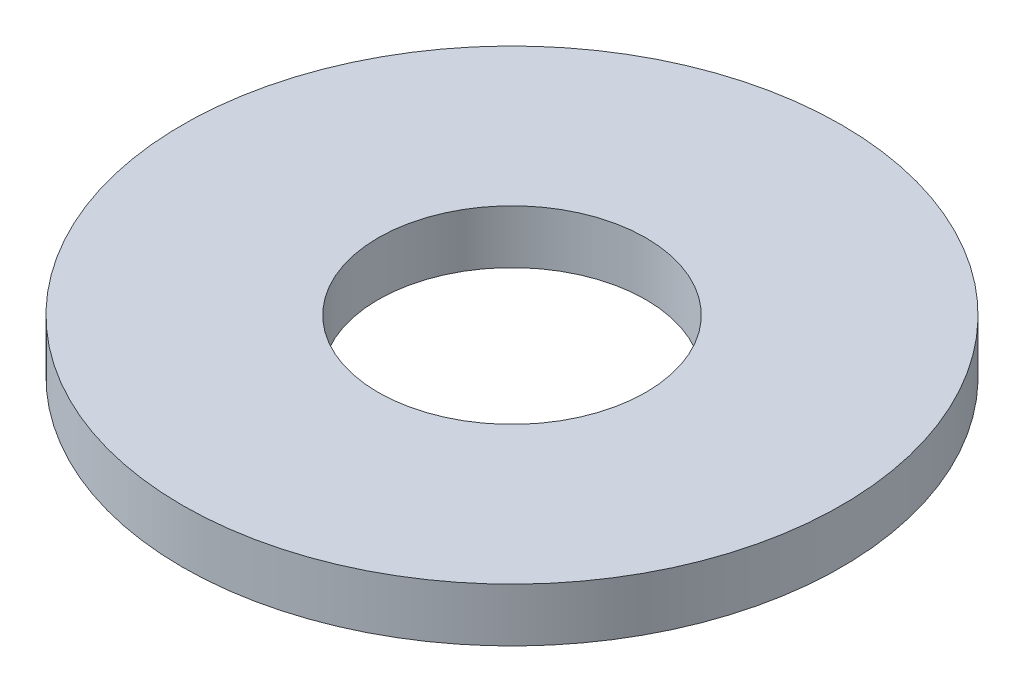
ISO-10303-21;
HEADER;
FILE_DESCRIPTION(('STEP AP214'),'2;1');
FILE_NAME('part.step','',(''),(''),'','','');
FILE_SCHEMA(('AUTOMOTIVE_DESIGN { 1 0 10303 214 1 1 1 1 }'));
ENDSEC;
DATA;
#1=APPLICATION_CONTEXT('core data for automotive mechanical design processes');
#2=APPLICATION_PROTOCOL_DEFINITION('international standard','automotive_design',2000,#1);
#3=PRODUCT_CONTEXT('',#1,'mechanical');
#4=PRODUCT('Part','Part','',(#3));
#5=PRODUCT_RELATED_PRODUCT_CATEGORY('part','',(#4));
#6=PRODUCT_DEFINITION_FORMATION('','',#4);
#7=PRODUCT_DEFINITION_CONTEXT('part definition',#1,'design');
#8=PRODUCT_DEFINITION('design','',#6,#7);
#9=PRODUCT_DEFINITION_SHAPE('','',#8);
#10=(LENGTH_UNIT() NAMED_UNIT(*) SI_UNIT(.MILLI.,.METRE.));
#11=(NAMED_UNIT(*) PLANE_ANGLE_UNIT() SI_UNIT($,.RADIAN.));
#12=(NAMED_UNIT(*) SI_UNIT($,.STERADIAN.) SOLID_ANGLE_UNIT());
#13=UNCERTAINTY_MEASURE_WITH_UNIT(LENGTH_MEASURE(1.E-05),#10,'distance_accuracy_value','');
#14=(GEOMETRIC_REPRESENTATION_CONTEXT(3) GLOBAL_UNCERTAINTY_ASSIGNED_CONTEXT((#13)) GLOBAL_UNIT_ASSIGNED_CONTEXT((#10,
#11,#12)) REPRESENTATION_CONTEXT('',''));
#15=CARTESIAN_POINT('',(0.,0.,0.));
#16=DIRECTION('',(0.,0.,1.));
#17=DIRECTION('',(1.,0.,0.));
#18=AXIS2_PLACEMENT_3D('',#15,#16,#17);
#19=CARTESIAN_POINT('',(0.,13.,0.));
#20=DIRECTION('',(0.,-1.,0.));
#21=DIRECTION('',(0.,0.,-1.));
#22=AXIS2_PLACEMENT_3D('',#19,#20,#21);
#23=CYLINDRICAL_SURFACE('',#22,80.);
#24=CARTESIAN_POINT('',(0.,13.,0.));
#25=DIRECTION('',(0.,1.,0.));
#26=DIRECTION('',(0.,0.,1.));
#27=AXIS2_PLACEMENT_3D('',#24,#25,#26);
#28=CIRCLE('',#27,80.);
#29=CARTESIAN_POINT('',(0.,13.,-80.));
#30=VERTEX_POINT('',#29);
#31=EDGE_CURVE('E10',#30,#30,#28,.T.);
#32=CARTESIAN_POINT('',(0.,0.,0.));
#33=DIRECTION('',(0.,1.,0.));
#34=DIRECTION('',(0.,0.,1.));
#35=AXIS2_PLACEMENT_3D('',#32,#33,#34);
#36=CIRCLE('',#35,80.);
#37=CARTESIAN_POINT('',(0.,0.,-80.));
#38=VERTEX_POINT('',#37);
#39=EDGE_CURVE('E37',#38,#38,#36,.T.);
#40=CARTESIAN_POINT('',(0.,13.,-80.));
#41=CARTESIAN_POINT('',(0.,12.8645833333333,-80.));
#42=CARTESIAN_POINT('',(0.,12.7291666666667,-80.));
#43=CARTESIAN_POINT('',(0.,12.4583333333333,-80.));
#44=CARTESIAN_POINT('',(0.,12.3229166666667,-80.));
#45=CARTESIAN_POINT('',(0.,12.0520833333333,-80.));
#46=CARTESIAN_POINT('',(0.,11.9166666666667,-80.));
#47=CARTESIAN_POINT('',(0.,11.6458333333333,-80.));
#48=CARTESIAN_POINT('',(0.,11.5104166666667,-80.));
#49=CARTESIAN_POINT('',(0.,11.2395833333333,-80.));
#50=CARTESIAN_POINT('',(0.,11.1041666666667,-80.));
#51=CARTESIAN_POINT('',(0.,10.8333333333333,-80.));
#52=CARTESIAN_POINT('',(0.,10.6979166666667,-80.));
#53=CARTESIAN_POINT('',(0.,10.4270833333333,-80.));
#54=CARTESIAN_POINT('',(0.,10.2916666666667,-80.));
#55=CARTESIAN_POINT('',(0.,10.0208333333333,-80.));
#56=CARTESIAN_POINT('',(0.,9.88541666666667,-80.));
#57=CARTESIAN_POINT('',(0.,9.61458333333333,-80.));
#58=CARTESIAN_POINT('',(0.,9.47916666666667,-80.));
#59=CARTESIAN_POINT('',(0.,9.20833333333333,-80.));
#60=CARTESIAN_POINT('',(0.,9.07291666666667,-80.));
#61=CARTESIAN_POINT('',(0.,8.80208333333333,-80.));
#62=CARTESIAN_POINT('',(0.,8.66666666666667,-80.));
#63=CARTESIAN_POINT('',(0.,8.39583333333333,-80.));
#64=CARTESIAN_POINT('',(0.,8.26041666666667,-80.));
#65=CARTESIAN_POINT('',(0.,7.98958333333333,-80.));
#66=CARTESIAN_POINT('',(0.,7.85416666666667,-80.));
#67=CARTESIAN_POINT('',(0.,7.58333333333333,-80.));
#68=CARTESIAN_POINT('',(0.,7.44791666666667,-80.));
#69=CARTESIAN_POINT('',(0.,7.17708333333333,-80.));
#70=CARTESIAN_POINT('',(0.,7.04166666666667,-80.));
#71=CARTESIAN_POINT('',(0.,6.77083333333333,-80.));
#72=CARTESIAN_POINT('',(0.,6.63541666666667,-80.));
#73=CARTESIAN_POINT('',(0.,6.36458333333333,-80.));
#74=CARTESIAN_POINT('',(0.,6.22916666666667,-80.));
#75=CARTESIAN_POINT('',(0.,5.95833333333333,-80.));
#76=CARTESIAN_POINT('',(0.,5.82291666666667,-80.));
#77=CARTESIAN_POINT('',(0.,5.55208333333333,-80.));
#78=CARTESIAN_POINT('',(0.,5.41666666666667,-80.));
#79=CARTESIAN_POINT('',(0.,5.14583333333333,-80.));
#80=CARTESIAN_POINT('',(0.,5.01041666666667,-80.));
#81=CARTESIAN_POINT('',(0.,4.73958333333333,-80.));
#82=CARTESIAN_POINT('',(0.,4.60416666666667,-80.));
#83=CARTESIAN_POINT('',(0.,4.33333333333333,-80.));
#84=CARTESIAN_POINT('',(0.,4.19791666666667,-80.));
#85=CARTESIAN_POINT('',(0.,3.92708333333333,-80.));
#86=CARTESIAN_POINT('',(0.,3.79166666666667,-80.));
#87=CARTESIAN_POINT('',(0.,3.52083333333333,-80.));
#88=CARTESIAN_POINT('',(0.,3.38541666666667,-80.));
#89=CARTESIAN_POINT('',(0.,3.11458333333333,-80.));
#90=CARTESIAN_POINT('',(0.,2.97916666666667,-80.));
#91=CARTESIAN_POINT('',(0.,2.70833333333333,-80.));
#92=CARTESIAN_POINT('',(0.,2.57291666666667,-80.));
#93=CARTESIAN_POINT('',(0.,2.30208333333333,-80.));
#94=CARTESIAN_POINT('',(0.,2.16666666666667,-80.));
#95=CARTESIAN_POINT('',(0.,1.89583333333333,-80.));
#96=CARTESIAN_POINT('',(0.,1.76041666666667,-80.));
#97=CARTESIAN_POINT('',(0.,1.48958333333333,-80.));
#98=CARTESIAN_POINT('',(0.,1.35416666666667,-80.));
#99=CARTESIAN_POINT('',(0.,1.08333333333333,-80.));
#100=CARTESIAN_POINT('',(0.,0.947916666666667,-80.));
#101=CARTESIAN_POINT('',(0.,0.677083333333334,-80.));
#102=CARTESIAN_POINT('',(0.,0.541666666666667,-80.));
#103=CARTESIAN_POINT('',(0.,0.270833333333334,-80.));
#104=CARTESIAN_POINT('',(0.,0.135416666666667,-80.));
#105=CARTESIAN_POINT('',(0.,0.,-80.));
#106=B_SPLINE_CURVE_WITH_KNOTS('',3,(#40,#41,#42,#43,#44,#45,#46,#47,#48,#49,#50,#51,#52,#53,
#54,#55,#56,#57,#58,#59,#60,#61,#62,#63,#64,#65,#66,#67,#68,#69,#70,#71,#72,#73,#74,#75,#76,#77,
#78,#79,#80,#81,#82,#83,#84,#85,#86,#87,#88,#89,#90,#91,#92,#93,#94,#95,#96,#97,#98,#99,#100,
#101,#102,#103,#104,#105),.UNSPECIFIED.,.F.,.F.,(4,2,2,2,2,2,2,2,2,2,2,2,2,2,2,2,2,2,2,2,2,2,2,
2,2,2,2,2,2,2,2,2,4),(0.,0.406249999999999,0.812499999999999,1.21875,1.625,2.03125,2.4375,
2.84375,3.25,3.65625,4.0625,4.46875,4.875,5.28125,5.6875,6.09375,6.5,6.90625,7.3125,7.71875,
8.125,8.53125,8.9375,9.34375,9.75,10.15625,10.5625,10.96875,11.375,11.78125,12.1875,12.59375,
13.),.UNSPECIFIED.);
#107=EDGE_CURVE('BSEAM40',#30,#38,#106,.T.);
#108=ORIENTED_EDGE('',*,*,#31,.F.);
#109=ORIENTED_EDGE('',*,*,#39,.T.);
#110=ORIENTED_EDGE('',*,*,#107,.T.);
#111=ORIENTED_EDGE('',*,*,#107,.F.);
#112=EDGE_LOOP('',(#108,#110,#109,#111));
#113=FACE_BOUND('',#112,.T.);
#114=ADVANCED_FACE('F40',(#113),#23,.T.);
#115=CARTESIAN_POINT('',(0.,13.,0.));
#116=DIRECTION('',(0.,1.,0.));
#117=DIRECTION('',(0.,0.,1.));
#118=AXIS2_PLACEMENT_3D('',#115,#116,#117);
#119=PLANE('',#118);
#120=CARTESIAN_POINT('',(0.,13.,0.));
#121=DIRECTION('',(0.,1.,0.));
#122=DIRECTION('',(0.,0.,1.));
#123=AXIS2_PLACEMENT_3D('',#120,#121,#122);
#124=CIRCLE('',#123,32.5);
#125=CARTESIAN_POINT('',(0.,13.,-32.5));
#126=VERTEX_POINT('',#125);
#127=EDGE_CURVE('E50',#126,#126,#124,.T.);
#128=ORIENTED_EDGE('',*,*,#127,.F.);
#129=EDGE_LOOP('',(#128));
#130=FACE_BOUND('',#129,.T.);
#131=ORIENTED_EDGE('',*,*,#31,.T.);
#132=EDGE_LOOP('',(#131));
#133=FACE_BOUND('',#132,.T.);
#134=ADVANCED_FACE('F59',(#130,#133),#119,.T.);
#135=CARTESIAN_POINT('',(0.,0.,0.));
#136=DIRECTION('',(0.,1.,0.));
#137=DIRECTION('',(0.,0.,1.));
#138=AXIS2_PLACEMENT_3D('',#135,#136,#137);
#139=PLANE('',#138);
#140=CARTESIAN_POINT('',(0.,0.,0.));
#141=DIRECTION('',(0.,1.,0.));
#142=DIRECTION('',(0.,0.,1.));
#143=AXIS2_PLACEMENT_3D('',#140,#141,#142);
#144=CIRCLE('',#143,32.5);
#145=CARTESIAN_POINT('',(0.,0.,-32.5));
#146=VERTEX_POINT('',#145);
#147=EDGE_CURVE('E47',#146,#146,#144,.T.);
#148=ORIENTED_EDGE('',*,*,#147,.T.);
#149=EDGE_LOOP('',(#148));
#150=FACE_BOUND('',#149,.T.);
#151=ORIENTED_EDGE('',*,*,#39,.F.);
#152=EDGE_LOOP('',(#151));
#153=FACE_BOUND('',#152,.T.);
#154=ADVANCED_FACE('F58',(#150,#153),#139,.F.);
#155=CARTESIAN_POINT('',(0.,13.,0.));
#156=DIRECTION('',(0.,-1.,0.));
#157=DIRECTION('',(0.,0.,-1.));
#158=AXIS2_PLACEMENT_3D('',#155,#156,#157);
#159=CYLINDRICAL_SURFACE('',#158,32.5);
#160=CARTESIAN_POINT('',(0.,13.,-32.5));
#161=CARTESIAN_POINT('',(0.,12.8645833333333,-32.5));
#162=CARTESIAN_POINT('',(0.,12.7291666666667,-32.5));
#163=CARTESIAN_POINT('',(0.,12.4583333333333,-32.5));
#164=CARTESIAN_POINT('',(0.,12.3229166666667,-32.5));
#165=CARTESIAN_POINT('',(0.,12.0520833333333,-32.5));
#166=CARTESIAN_POINT('',(0.,11.9166666666667,-32.5));
#167=CARTESIAN_POINT('',(0.,11.6458333333333,-32.5));
#168=CARTESIAN_POINT('',(0.,11.5104166666667,-32.5));
#169=CARTESIAN_POINT('',(0.,11.2395833333333,-32.5));
#170=CARTESIAN_POINT('',(0.,11.1041666666667,-32.5));
#171=CARTESIAN_POINT('',(0.,10.8333333333333,-32.5));
#172=CARTESIAN_POINT('',(0.,10.6979166666667,-32.5));
#173=CARTESIAN_POINT('',(0.,10.4270833333333,-32.5));
#174=CARTESIAN_POINT('',(0.,10.2916666666667,-32.5));
#175=CARTESIAN_POINT('',(0.,10.0208333333333,-32.5));
#176=CARTESIAN_POINT('',(0.,9.88541666666667,-32.5));
#177=CARTESIAN_POINT('',(0.,9.61458333333333,-32.5));
#178=CARTESIAN_POINT('',(0.,9.47916666666667,-32.5));
#179=CARTESIAN_POINT('',(0.,9.20833333333333,-32.5));
#180=CARTESIAN_POINT('',(0.,9.07291666666667,-32.5));
#181=CARTESIAN_POINT('',(0.,8.80208333333333,-32.5));
#182=CARTESIAN_POINT('',(0.,8.66666666666667,-32.5));
#183=CARTESIAN_POINT('',(0.,8.39583333333333,-32.5));
#184=CARTESIAN_POINT('',(0.,8.26041666666667,-32.5));
#185=CARTESIAN_POINT('',(0.,7.98958333333333,-32.5));
#186=CARTESIAN_POINT('',(0.,7.85416666666667,-32.5));
#187=CARTESIAN_POINT('',(0.,7.58333333333333,-32.5));
#188=CARTESIAN_POINT('',(0.,7.44791666666667,-32.5));
#189=CARTESIAN_POINT('',(0.,7.17708333333333,-32.5));
#190=CARTESIAN_POINT('',(0.,7.04166666666667,-32.5));
#191=CARTESIAN_POINT('',(0.,6.77083333333333,-32.5));
#192=CARTESIAN_POINT('',(0.,6.63541666666667,-32.5));
#193=CARTESIAN_POINT('',(0.,6.36458333333333,-32.5));
#194=CARTESIAN_POINT('',(0.,6.22916666666667,-32.5));
#195=CARTESIAN_POINT('',(0.,5.95833333333333,-32.5));
#196=CARTESIAN_POINT('',(0.,5.82291666666667,-32.5));
#197=CARTESIAN_POINT('',(0.,5.55208333333333,-32.5));
#198=CARTESIAN_POINT('',(0.,5.41666666666667,-32.5));
#199=CARTESIAN_POINT('',(0.,5.14583333333333,-32.5));
#200=CARTESIAN_POINT('',(0.,5.01041666666667,-32.5));
#201=CARTESIAN_POINT('',(0.,4.73958333333333,-32.5));
#202=CARTESIAN_POINT('',(0.,4.60416666666667,-32.5));
#203=CARTESIAN_POINT('',(0.,4.33333333333333,-32.5));
#204=CARTESIAN_POINT('',(0.,4.19791666666667,-32.5));
#205=CARTESIAN_POINT('',(0.,3.92708333333333,-32.5));
#206=CARTESIAN_POINT('',(0.,3.79166666666667,-32.5));
#207=CARTESIAN_POINT('',(0.,3.52083333333333,-32.5));
#208=CARTESIAN_POINT('',(0.,3.38541666666667,-32.5));
#209=CARTESIAN_POINT('',(0.,3.11458333333333,-32.5));
#210=CARTESIAN_POINT('',(0.,2.97916666666667,-32.5));
#211=CARTESIAN_POINT('',(0.,2.70833333333333,-32.5));
#212=CARTESIAN_POINT('',(0.,2.57291666666667,-32.5));
#213=CARTESIAN_POINT('',(0.,2.30208333333333,-32.5));
#214=CARTESIAN_POINT('',(0.,2.16666666666667,-32.5));
#215=CARTESIAN_POINT('',(0.,1.89583333333333,-32.5));
#216=CARTESIAN_POINT('',(0.,1.76041666666667,-32.5));
#217=CARTESIAN_POINT('',(0.,1.48958333333333,-32.5));
#218=CARTESIAN_POINT('',(0.,1.35416666666667,-32.5));
#219=CARTESIAN_POINT('',(0.,1.08333333333333,-32.5));
#220=CARTESIAN_POINT('',(0.,0.947916666666667,-32.5));
#221=CARTESIAN_POINT('',(0.,0.677083333333334,-32.5));
#222=CARTESIAN_POINT('',(0.,0.541666666666667,-32.5));
#223=CARTESIAN_POINT('',(0.,0.270833333333334,-32.5));
#224=CARTESIAN_POINT('',(0.,0.135416666666667,-32.5));
#225=CARTESIAN_POINT('',(0.,0.,-32.5));
#226=B_SPLINE_CURVE_WITH_KNOTS('',3,(#160,#161,#162,#163,#164,#165,#166,#167,#168,#169,#170,
#171,#172,#173,#174,#175,#176,#177,#178,#179,#180,#181,#182,#183,#184,#185,#186,#187,#188,#189,
#190,#191,#192,#193,#194,#195,#196,#197,#198,#199,#200,#201,#202,#203,#204,#205,#206,#207,#208,
#209,#210,#211,#212,#213,#214,#215,#216,#217,#218,#219,#220,#221,#222,#223,#224,#225),
.UNSPECIFIED.,.F.,.F.,(4,2,2,2,2,2,2,2,2,2,2,2,2,2,2,2,2,2,2,2,2,2,2,2,2,2,2,2,2,2,2,2,4),(0.,
0.406249999999999,0.812499999999999,1.21875,1.625,2.03125,2.4375,2.84375,3.25,3.65625,4.0625,
4.46875,4.875,5.28125,5.6875,6.09375,6.5,6.90625,7.3125,7.71875,8.125,8.53125,8.9375,9.34375,
9.75,10.15625,10.5625,10.96875,11.375,11.78125,12.1875,12.59375,13.),.UNSPECIFIED.);
#227=EDGE_CURVE('BSEAM54',#126,#146,#226,.T.);
#228=ORIENTED_EDGE('',*,*,#127,.T.);
#229=ORIENTED_EDGE('',*,*,#147,.F.);
#230=ORIENTED_EDGE('',*,*,#227,.T.);
#231=ORIENTED_EDGE('',*,*,#227,.F.);
#232=EDGE_LOOP('',(#228,#230,#229,#231));
#233=FACE_BOUND('',#232,.T.);
#234=ADVANCED_FACE('F54',(#233),#159,.F.);
#235=CLOSED_SHELL('',(#114,#134,#154,#234));
#236=MANIFOLD_SOLID_BREP('B2',#235);
#237=ADVANCED_BREP_SHAPE_REPRESENTATION('',(#18,#236),#14);
#238=SHAPE_DEFINITION_REPRESENTATION(#9,#237);
ENDSEC;
END-ISO-10303-21;
